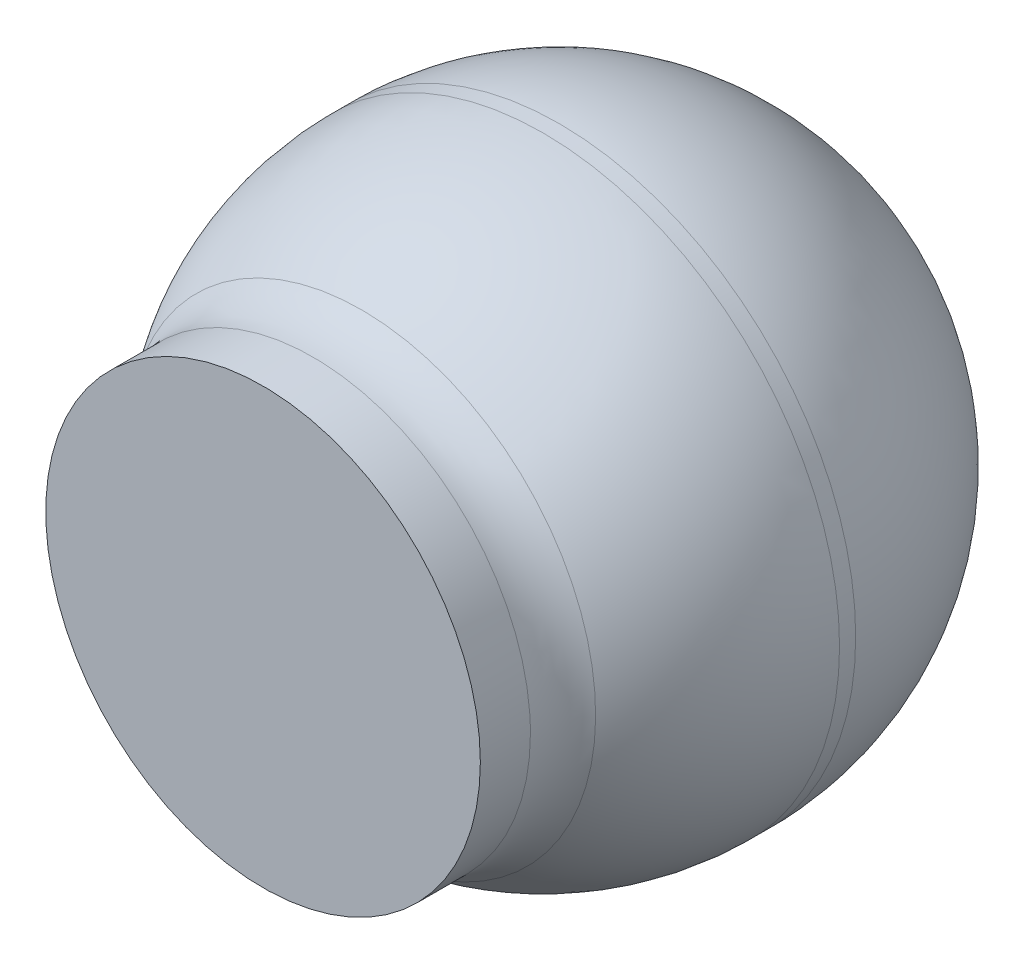
ISO-10303-21;
HEADER;
FILE_DESCRIPTION(('STEP AP214'),'2;1');
FILE_NAME('part.step','',(''),(''),'','','');
FILE_SCHEMA(('AUTOMOTIVE_DESIGN { 1 0 10303 214 1 1 1 1 }'));
ENDSEC;
DATA;
#1=APPLICATION_CONTEXT('core data for automotive mechanical design processes');
#2=APPLICATION_PROTOCOL_DEFINITION('international standard','automotive_design',2000,#1);
#3=PRODUCT_CONTEXT('',#1,'mechanical');
#4=PRODUCT('Part','Part','',(#3));
#5=PRODUCT_RELATED_PRODUCT_CATEGORY('part','',(#4));
#6=PRODUCT_DEFINITION_FORMATION('','',#4);
#7=PRODUCT_DEFINITION_CONTEXT('part definition',#1,'design');
#8=PRODUCT_DEFINITION('design','',#6,#7);
#9=PRODUCT_DEFINITION_SHAPE('','',#8);
#10=(LENGTH_UNIT() NAMED_UNIT(*) SI_UNIT(.MILLI.,.METRE.));
#11=(NAMED_UNIT(*) PLANE_ANGLE_UNIT() SI_UNIT($,.RADIAN.));
#12=(NAMED_UNIT(*) SI_UNIT($,.STERADIAN.) SOLID_ANGLE_UNIT());
#13=UNCERTAINTY_MEASURE_WITH_UNIT(LENGTH_MEASURE(1.E-05),#10,'distance_accuracy_value','');
#14=(GEOMETRIC_REPRESENTATION_CONTEXT(3) GLOBAL_UNCERTAINTY_ASSIGNED_CONTEXT((#13)) GLOBAL_UNIT_ASSIGNED_CONTEXT((#10,
#11,#12)) REPRESENTATION_CONTEXT('',''));
#15=CARTESIAN_POINT('',(0.,0.,0.));
#16=DIRECTION('',(0.,0.,1.));
#17=DIRECTION('',(1.,0.,0.));
#18=AXIS2_PLACEMENT_3D('',#15,#16,#17);
#19=CARTESIAN_POINT('',(-6.912919922269,-0.241349291452,10.006534503384));
#20=DIRECTION('',(0.,0.,-1.));
#21=DIRECTION('',(-1.,0.,0.));
#22=AXIS2_PLACEMENT_3D('',#19,#20,#21);
#23=PLANE('',#22);
#24=CARTESIAN_POINT('',(-6.912919922269,-0.241349291452,10.006534503384));
#25=DIRECTION('',(0.,0.,1.));
#26=DIRECTION('',(1.,0.,0.));
#27=AXIS2_PLACEMENT_3D('',#24,#25,#26);
#28=CIRCLE('',#27,0.275);
#29=CARTESIAN_POINT('',(-6.637919922269,-0.241349291452,10.006534503384));
#30=VERTEX_POINT('',#29);
#31=EDGE_CURVE('E20',#30,#30,#28,.F.);
#32=ORIENTED_EDGE('',*,*,#31,.F.);
#33=EDGE_LOOP('',(#32));
#34=FACE_BOUND('',#33,.T.);
#35=ADVANCED_FACE('F17',(#34),#23,.F.);
#36=CARTESIAN_POINT('',(-6.912919922269,-0.241349291452,9.906534503384));
#37=DIRECTION('',(0.,0.,1.));
#38=DIRECTION('',(1.,0.,0.));
#39=AXIS2_PLACEMENT_3D('',#36,#37,#38);
#40=CYLINDRICAL_SURFACE('',#39,0.275);
#41=CARTESIAN_POINT('',(-6.912919922269,-0.241349291452,9.943180457728));
#42=DIRECTION('',(0.,0.,-1.));
#43=DIRECTION('',(0.996700902337582,0.0811622527992461,0.));
#44=AXIS2_PLACEMENT_3D('',#41,#42,#43);
#45=CIRCLE('',#44,0.275);
#46=CARTESIAN_POINT('',(-6.63882717412617,-0.219029671932207,9.943180457728));
#47=VERTEX_POINT('',#46);
#48=EDGE_CURVE('E65',#47,#47,#45,.F.);
#49=ORIENTED_EDGE('',*,*,#48,.T.);
#50=EDGE_LOOP('',(#49));
#51=FACE_BOUND('',#50,.T.);
#52=ORIENTED_EDGE('',*,*,#31,.T.);
#53=EDGE_LOOP('',(#52));
#54=FACE_BOUND('',#53,.T.);
#55=ADVANCED_FACE('F62',(#51,#54),#40,.T.);
#56=CARTESIAN_POINT('',(-6.912919922269,-0.241349291452,9.943180457728));
#57=DIRECTION('',(0.,0.,-1.));
#58=DIRECTION('',(0.996700902337583,0.081162252799246,0.));
#59=AXIS2_PLACEMENT_3D('',#56,#57,#58);
#60=TOROIDAL_SURFACE('',#59,0.375,0.1);
#61=ORIENTED_EDGE('',*,*,#48,.F.);
#62=EDGE_LOOP('',(#61));
#63=FACE_BOUND('',#62,.T.);
#64=CARTESIAN_POINT('',(-6.912919922269,-0.241349291452,9.881744931236));
#65=DIRECTION('',(0.,0.,-1.));
#66=DIRECTION('',(-0.996700902337598,-0.0811622527990607,0.));
#67=AXIS2_PLACEMENT_3D('',#64,#65,#66);
#68=CIRCLE('',#67,0.296097046412665);
#69=CARTESIAN_POINT('',(-7.208040115608,-0.265381194786,9.881744931236));
#70=VERTEX_POINT('',#69);
#71=EDGE_CURVE('E39',#70,#70,#68,.T.);
#72=ORIENTED_EDGE('',*,*,#71,.F.);
#73=EDGE_LOOP('',(#72));
#74=FACE_BOUND('',#73,.T.);
#75=ADVANCED_FACE('F57',(#63,#74),#60,.F.);
#76=CARTESIAN_POINT('',(-7.286682760645,-0.271785136252,9.651976062157));
#77=CARTESIAN_POINT('',(-7.286682760645,-0.271785136252,9.701461392103));
#78=CARTESIAN_POINT('',(-7.278526217348,-0.271120941579,9.750947004335));
#79=CARTESIAN_POINT('',(-7.262207085349,-0.269792059952,9.798626332798));
#80=CARTESIAN_POINT('',(-7.238341390838,-0.267848654938,9.842699544317));
#81=CARTESIAN_POINT('',(-7.208040115608,-0.265381194786,9.881744931236));
#82=(BOUNDED_CURVE() B_SPLINE_CURVE(5,(#76,#77,#78,#79,#80,#81),.UNSPECIFIED.,.F.,
.F.) B_SPLINE_CURVE_WITH_KNOTS((6,6),(0.,0.661568582165),
.UNSPECIFIED.) CURVE() GEOMETRIC_REPRESENTATION_ITEM() RATIONAL_B_SPLINE_CURVE((1.,1.,1.,1.,1.,1.)) REPRESENTATION_ITEM(''));
#83=CARTESIAN_POINT('',(-6.912919922269,-0.241349291452,9.651976062157));
#84=DIRECTION('',(0.,0.,-1.));
#85=AXIS1_PLACEMENT('',#83,#84);
#86=SURFACE_OF_REVOLUTION('',#82,#85);
#87=CARTESIAN_POINT('',(-6.912919922269,-0.241349291452,9.651976062157));
#88=DIRECTION('',(0.,0.,1.));
#89=DIRECTION('',(1.,0.,0.));
#90=AXIS2_PLACEMENT_3D('',#87,#88,#89);
#91=CIRCLE('',#90,0.375);
#92=CARTESIAN_POINT('',(-6.537919922269,-0.241349291452,9.651976062157));
#93=VERTEX_POINT('',#92);
#94=EDGE_CURVE('E36',#93,#93,#91,.F.);
#95=ORIENTED_EDGE('',*,*,#94,.F.);
#96=EDGE_LOOP('',(#95));
#97=FACE_BOUND('',#96,.T.);
#98=ORIENTED_EDGE('',*,*,#71,.T.);
#99=EDGE_LOOP('',(#98));
#100=FACE_BOUND('',#99,.T.);
#101=ADVANCED_FACE('F53',(#97,#100),#86,.F.);
#102=CARTESIAN_POINT('',(-6.912919922269,-0.241349291452,9.256534503384));
#103=DIRECTION('',(0.,0.,1.));
#104=DIRECTION('',(1.,0.,0.));
#105=AXIS2_PLACEMENT_3D('',#102,#103,#104);
#106=CYLINDRICAL_SURFACE('',#105,0.375);
#107=CARTESIAN_POINT('',(-6.912919922269,-0.241349291452,9.631534503384));
#108=DIRECTION('',(0.,0.,-1.));
#109=DIRECTION('',(0.0811622527992356,-0.996700902337583,0.));
#110=AXIS2_PLACEMENT_3D('',#107,#108,#109);
#111=CIRCLE('',#110,0.375);
#112=CARTESIAN_POINT('',(-6.88248407746929,-0.615112129828594,9.631534503384));
#113=VERTEX_POINT('',#112);
#114=CARTESIAN_POINT('',(-6.94335576706871,0.132413546924594,9.631534503384));
#115=VERTEX_POINT('',#114);
#116=EDGE_CURVE('E11',#113,#115,#111,.T.);
#117=ORIENTED_EDGE('',*,*,#116,.F.);
#118=CARTESIAN_POINT('',(-6.912919922269,-0.241349291452,9.631534503384));
#119=DIRECTION('',(0.,0.,1.));
#120=DIRECTION('',(0.0811622527992365,-0.996700902337583,0.));
#121=AXIS2_PLACEMENT_3D('',#118,#119,#120);
#122=CIRCLE('',#121,0.375);
#123=EDGE_CURVE('E25',#115,#113,#122,.F.);
#124=ORIENTED_EDGE('',*,*,#123,.F.);
#125=EDGE_LOOP('',(#117,#124));
#126=FACE_BOUND('',#125,.T.);
#127=ORIENTED_EDGE('',*,*,#94,.T.);
#128=EDGE_LOOP('',(#127));
#129=FACE_BOUND('',#128,.T.);
#130=ADVANCED_FACE('F34',(#126,#129),#106,.T.);
#131=CARTESIAN_POINT('',(-6.912919922269,-0.241349291452,9.631534503384));
#132=DIRECTION('',(0.0811622527992361,-0.996700902337583,0.));
#133=DIRECTION('',(-0.996700902337583,-0.0811622527992361,0.));
#134=AXIS2_PLACEMENT_3D('',#131,#132,#133);
#135=SPHERICAL_SURFACE('',#134,0.375);
#136=ORIENTED_EDGE('',*,*,#123,.T.);
#137=ORIENTED_EDGE('',*,*,#116,.T.);
#138=EDGE_LOOP('',(#136,#137));
#139=FACE_BOUND('',#138,.T.);
#140=ADVANCED_FACE('F32',(#139),#135,.T.);
#141=CLOSED_SHELL('',(#35,#55,#75,#101,#130,#140));
#142=MANIFOLD_SOLID_BREP('B1',#141);
#143=ADVANCED_BREP_SHAPE_REPRESENTATION('',(#18,#142),#14);
#144=SHAPE_DEFINITION_REPRESENTATION(#9,#143);
ENDSEC;
END-ISO-10303-21;
